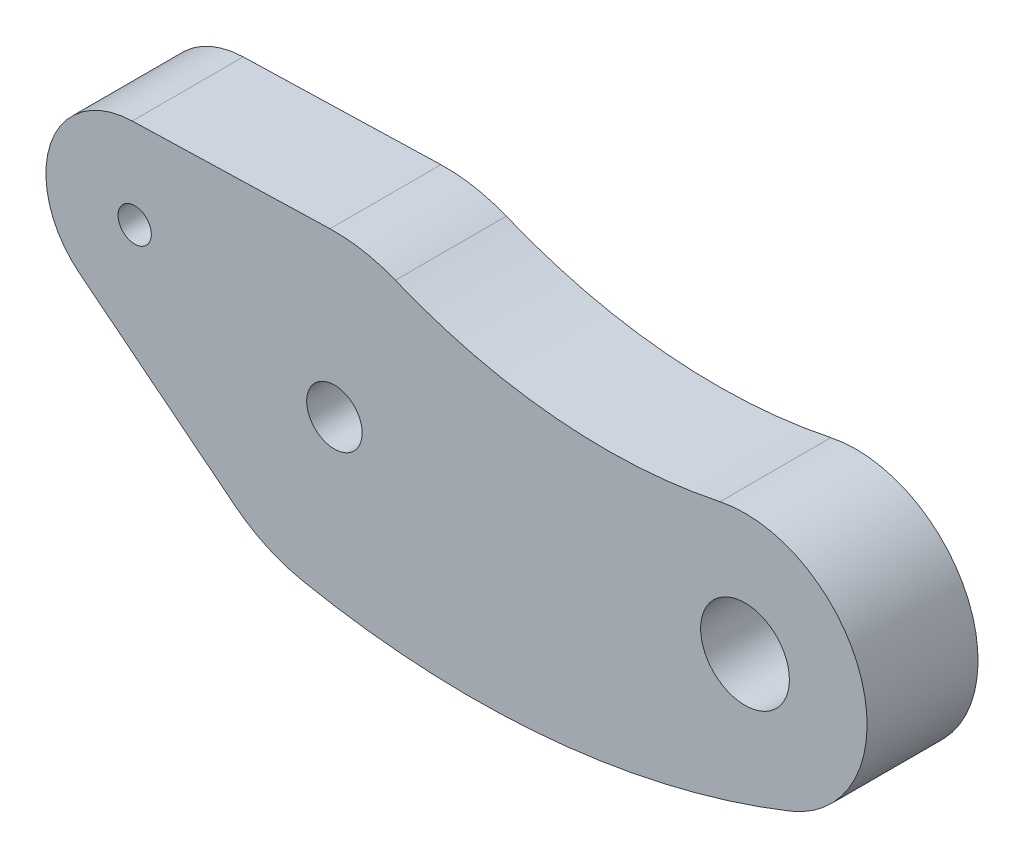
ISO-10303-21;
HEADER;
FILE_DESCRIPTION(('STEP AP214'),'2;1');
FILE_NAME('part.step','',(''),(''),'','','');
FILE_SCHEMA(('AUTOMOTIVE_DESIGN { 1 0 10303 214 1 1 1 1 }'));
ENDSEC;
DATA;
#1=APPLICATION_CONTEXT('core data for automotive mechanical design processes');
#2=APPLICATION_PROTOCOL_DEFINITION('international standard','automotive_design',2000,#1);
#3=PRODUCT_CONTEXT('',#1,'mechanical');
#4=PRODUCT('Part','Part','',(#3));
#5=PRODUCT_RELATED_PRODUCT_CATEGORY('part','',(#4));
#6=PRODUCT_DEFINITION_FORMATION('','',#4);
#7=PRODUCT_DEFINITION_CONTEXT('part definition',#1,'design');
#8=PRODUCT_DEFINITION('design','',#6,#7);
#9=PRODUCT_DEFINITION_SHAPE('','',#8);
#10=(LENGTH_UNIT() NAMED_UNIT(*) SI_UNIT(.MILLI.,.METRE.));
#11=(NAMED_UNIT(*) PLANE_ANGLE_UNIT() SI_UNIT($,.RADIAN.));
#12=(NAMED_UNIT(*) SI_UNIT($,.STERADIAN.) SOLID_ANGLE_UNIT());
#13=UNCERTAINTY_MEASURE_WITH_UNIT(LENGTH_MEASURE(1.E-05),#10,'distance_accuracy_value','');
#14=(GEOMETRIC_REPRESENTATION_CONTEXT(3) GLOBAL_UNCERTAINTY_ASSIGNED_CONTEXT((#13)) GLOBAL_UNIT_ASSIGNED_CONTEXT((#10,
#11,#12)) REPRESENTATION_CONTEXT('',''));
#15=CARTESIAN_POINT('',(0.,0.,0.));
#16=DIRECTION('',(0.,0.,1.));
#17=DIRECTION('',(1.,0.,0.));
#18=AXIS2_PLACEMENT_3D('',#15,#16,#17);
#19=CARTESIAN_POINT('',(0.,0.,5.));
#20=DIRECTION('',(0.,0.,1.));
#21=DIRECTION('',(1.,0.,0.));
#22=AXIS2_PLACEMENT_3D('',#19,#20,#21);
#23=PLANE('',#22);
#24=CARTESIAN_POINT('',(18.5,0.,5.));
#25=DIRECTION('',(0.,0.,1.));
#26=DIRECTION('',(1.,0.,0.));
#27=AXIS2_PLACEMENT_3D('',#24,#25,#26);
#28=CIRCLE('',#27,2.);
#29=CARTESIAN_POINT('',(20.5,0.,5.));
#30=VERTEX_POINT('',#29);
#31=EDGE_CURVE('E190',#30,#30,#28,.T.);
#32=ORIENTED_EDGE('',*,*,#31,.F.);
#33=EDGE_LOOP('',(#32));
#34=FACE_BOUND('',#33,.T.);
#35=CARTESIAN_POINT('',(0.,0.,5.));
#36=DIRECTION('',(0.,0.,1.));
#37=DIRECTION('',(1.,0.,0.));
#38=AXIS2_PLACEMENT_3D('',#35,#36,#37);
#39=CIRCLE('',#38,7.25);
#40=CARTESIAN_POINT('',(-4.51016983595542,-5.67634284119959,5.));
#41=VERTEX_POINT('',#40);
#42=CARTESIAN_POINT('',(-1.41925562194959,-7.10972668107322,5.));
#43=VERTEX_POINT('',#42);
#44=EDGE_CURVE('E153',#41,#43,#39,.T.);
#45=ORIENTED_EDGE('',*,*,#44,.T.);
#46=CARTESIAN_POINT('',(6.18063265327038,30.9617296569213,5.));
#47=DIRECTION('',(0.,0.,1.));
#48=DIRECTION('',(1.,0.,0.));
#49=AXIS2_PLACEMENT_3D('',#46,#47,#48);
#50=CIRCLE('',#49,38.8225976654274);
#51=CARTESIAN_POINT('',(20.5333504934794,-5.11033127797671,5.));
#52=VERTEX_POINT('',#51);
#53=EDGE_CURVE('E101',#43,#52,#50,.T.);
#54=ORIENTED_EDGE('',*,*,#53,.T.);
#55=CARTESIAN_POINT('',(18.5,0.,5.));
#56=DIRECTION('',(0.,0.,1.));
#57=DIRECTION('',(1.,0.,0.));
#58=AXIS2_PLACEMENT_3D('',#55,#56,#57);
#59=CIRCLE('',#58,5.5);
#60=CARTESIAN_POINT('',(17.369721809805,5.38260821654053,5.));
#61=VERTEX_POINT('',#60);
#62=EDGE_CURVE('E168',#52,#61,#59,.T.);
#63=ORIENTED_EDGE('',*,*,#62,.T.);
#64=CARTESIAN_POINT('',(12.2223776967446,29.8952785986359,5.));
#65=DIRECTION('',(0.,0.,-1.));
#66=DIRECTION('',(1.,0.,0.));
#67=AXIS2_PLACEMENT_3D('',#64,#65,#66);
#68=CIRCLE('',#67,25.0472785084431);
#69=CARTESIAN_POINT('',(2.74364412091977,6.71080598272238,5.));
#70=VERTEX_POINT('',#69);
#71=EDGE_CURVE('E181',#61,#70,#68,.T.);
#72=ORIENTED_EDGE('',*,*,#71,.T.);
#73=CARTESIAN_POINT('',(0.,0.,5.));
#74=DIRECTION('',(0.,0.,1.));
#75=DIRECTION('',(1.,0.,0.));
#76=AXIS2_PLACEMENT_3D('',#73,#74,#75);
#77=CIRCLE('',#76,7.25);
#78=CARTESIAN_POINT('',(-0.20233016404458,7.24717617453293,5.));
#79=VERTEX_POINT('',#78);
#80=EDGE_CURVE('E120',#70,#79,#77,.T.);
#81=ORIENTED_EDGE('',*,*,#80,.T.);
#82=DIRECTION('',(-0.999610506832128,-0.0279076088337353,0.));
#83=VECTOR('',#82,1.);
#84=CARTESIAN_POINT('',(-9.11163043533494,6.99844202732851,5.));
#85=LINE('',#84,#83);
#86=CARTESIAN_POINT('',(-9.11163043533494,6.99844202732851,5.));
#87=VERTEX_POINT('',#86);
#88=EDGE_CURVE('E114',#79,#87,#85,.T.);
#89=ORIENTED_EDGE('',*,*,#88,.T.);
#90=CARTESIAN_POINT('',(-9.,3.,5.));
#91=DIRECTION('',(0.,0.,1.));
#92=DIRECTION('',(1.,0.,0.));
#93=AXIS2_PLACEMENT_3D('',#90,#91,#92);
#94=CIRCLE('',#93,4.);
#95=CARTESIAN_POINT('',(-11.4883695646651,-0.131775360661842,5.));
#96=VERTEX_POINT('',#95);
#97=EDGE_CURVE('E118',#87,#96,#94,.T.);
#98=ORIENTED_EDGE('',*,*,#97,.T.);
#99=DIRECTION('',(0.782943840165461,-0.622092391166265,0.));
#100=VECTOR('',#99,1.);
#101=CARTESIAN_POINT('',(-11.4883695646651,-0.131775360661846,5.));
#102=LINE('',#101,#100);
#103=EDGE_CURVE('E58',#96,#41,#102,.T.);
#104=ORIENTED_EDGE('',*,*,#103,.T.);
#105=EDGE_LOOP('',(#45,#54,#63,#72,#81,#89,#98,#104));
#106=FACE_BOUND('',#105,.T.);
#107=CARTESIAN_POINT('',(0.,0.,5.));
#108=DIRECTION('',(0.,0.,1.));
#109=DIRECTION('',(1.,0.,0.));
#110=AXIS2_PLACEMENT_3D('',#107,#108,#109);
#111=CIRCLE('',#110,1.25);
#112=CARTESIAN_POINT('',(1.25,0.,5.));
#113=VERTEX_POINT('',#112);
#114=EDGE_CURVE('E142',#113,#113,#111,.T.);
#115=ORIENTED_EDGE('',*,*,#114,.F.);
#116=EDGE_LOOP('',(#115));
#117=FACE_BOUND('',#116,.T.);
#118=CARTESIAN_POINT('',(-9.,3.,5.));
#119=DIRECTION('',(0.,0.,1.));
#120=DIRECTION('',(1.,0.,0.));
#121=AXIS2_PLACEMENT_3D('',#118,#119,#120);
#122=CIRCLE('',#121,0.75);
#123=CARTESIAN_POINT('',(-8.25,3.,5.));
#124=VERTEX_POINT('',#123);
#125=EDGE_CURVE('E196',#124,#124,#122,.T.);
#126=ORIENTED_EDGE('',*,*,#125,.F.);
#127=EDGE_LOOP('',(#126));
#128=FACE_BOUND('',#127,.T.);
#129=ADVANCED_FACE('F41',(#34,#106,#117,#128),#23,.T.);
#130=CARTESIAN_POINT('',(0.,0.,0.));
#131=DIRECTION('',(0.,0.,1.));
#132=DIRECTION('',(1.,0.,0.));
#133=AXIS2_PLACEMENT_3D('',#130,#131,#132);
#134=PLANE('',#133);
#135=CARTESIAN_POINT('',(0.,0.,0.));
#136=DIRECTION('',(0.,0.,1.));
#137=DIRECTION('',(1.,0.,0.));
#138=AXIS2_PLACEMENT_3D('',#135,#136,#137);
#139=CIRCLE('',#138,7.25);
#140=CARTESIAN_POINT('',(-4.51016983595542,-5.67634284119959,0.));
#141=VERTEX_POINT('',#140);
#142=CARTESIAN_POINT('',(-1.41925562194959,-7.10972668107322,0.));
#143=VERTEX_POINT('',#142);
#144=EDGE_CURVE('E138',#141,#143,#139,.T.);
#145=ORIENTED_EDGE('',*,*,#144,.F.);
#146=DIRECTION('',(0.782943840165461,-0.622092391166265,0.));
#147=VECTOR('',#146,1.);
#148=CARTESIAN_POINT('',(-11.4883695646651,-0.131775360661846,0.));
#149=LINE('',#148,#147);
#150=CARTESIAN_POINT('',(-11.4883695646651,-0.131775360661842,0.));
#151=VERTEX_POINT('',#150);
#152=EDGE_CURVE('E93',#151,#141,#149,.T.);
#153=ORIENTED_EDGE('',*,*,#152,.F.);
#154=CARTESIAN_POINT('',(-9.,3.,0.));
#155=DIRECTION('',(0.,0.,1.));
#156=DIRECTION('',(1.,0.,0.));
#157=AXIS2_PLACEMENT_3D('',#154,#155,#156);
#158=CIRCLE('',#157,4.);
#159=CARTESIAN_POINT('',(-9.11163043533494,6.99844202732851,0.));
#160=VERTEX_POINT('',#159);
#161=EDGE_CURVE('E87',#160,#151,#158,.T.);
#162=ORIENTED_EDGE('',*,*,#161,.F.);
#163=DIRECTION('',(-0.999610506832128,-0.0279076088337353,0.));
#164=VECTOR('',#163,1.);
#165=CARTESIAN_POINT('',(-9.11163043533494,6.99844202732851,0.));
#166=LINE('',#165,#164);
#167=CARTESIAN_POINT('',(-0.20233016404458,7.24717617453293,0.));
#168=VERTEX_POINT('',#167);
#169=EDGE_CURVE('E128',#168,#160,#166,.T.);
#170=ORIENTED_EDGE('',*,*,#169,.F.);
#171=CARTESIAN_POINT('',(0.,0.,0.));
#172=DIRECTION('',(0.,0.,1.));
#173=DIRECTION('',(1.,0.,0.));
#174=AXIS2_PLACEMENT_3D('',#171,#172,#173);
#175=CIRCLE('',#174,7.25);
#176=CARTESIAN_POINT('',(2.74364412091977,6.71080598272238,0.));
#177=VERTEX_POINT('',#176);
#178=EDGE_CURVE('E148',#177,#168,#175,.T.);
#179=ORIENTED_EDGE('',*,*,#178,.F.);
#180=CARTESIAN_POINT('',(12.2223776967446,29.8952785986359,0.));
#181=DIRECTION('',(0.,0.,-1.));
#182=DIRECTION('',(1.,0.,0.));
#183=AXIS2_PLACEMENT_3D('',#180,#181,#182);
#184=CIRCLE('',#183,25.0472785084431);
#185=CARTESIAN_POINT('',(17.369721809805,5.38260821654053,0.));
#186=VERTEX_POINT('',#185);
#187=EDGE_CURVE('E146',#186,#177,#184,.T.);
#188=ORIENTED_EDGE('',*,*,#187,.F.);
#189=CARTESIAN_POINT('',(18.5,0.,0.));
#190=DIRECTION('',(0.,0.,1.));
#191=DIRECTION('',(1.,0.,0.));
#192=AXIS2_PLACEMENT_3D('',#189,#190,#191);
#193=CIRCLE('',#192,5.5);
#194=CARTESIAN_POINT('',(20.5333504934794,-5.11033127797671,0.));
#195=VERTEX_POINT('',#194);
#196=EDGE_CURVE('E144',#195,#186,#193,.T.);
#197=ORIENTED_EDGE('',*,*,#196,.F.);
#198=CARTESIAN_POINT('',(6.18063265327038,30.9617296569213,0.));
#199=DIRECTION('',(0.,0.,1.));
#200=DIRECTION('',(1.,0.,0.));
#201=AXIS2_PLACEMENT_3D('',#198,#199,#200);
#202=CIRCLE('',#201,38.8225976654274);
#203=EDGE_CURVE('E141',#143,#195,#202,.T.);
#204=ORIENTED_EDGE('',*,*,#203,.F.);
#205=EDGE_LOOP('',(#145,#153,#162,#170,#179,#188,#197,#204));
#206=FACE_BOUND('',#205,.T.);
#207=CARTESIAN_POINT('',(0.,0.,0.));
#208=DIRECTION('',(0.,0.,1.));
#209=DIRECTION('',(1.,0.,0.));
#210=AXIS2_PLACEMENT_3D('',#207,#208,#209);
#211=CIRCLE('',#210,1.25);
#212=CARTESIAN_POINT('',(1.25,0.,0.));
#213=VERTEX_POINT('',#212);
#214=EDGE_CURVE('E187',#213,#213,#211,.T.);
#215=ORIENTED_EDGE('',*,*,#214,.T.);
#216=EDGE_LOOP('',(#215));
#217=FACE_BOUND('',#216,.T.);
#218=CARTESIAN_POINT('',(18.5,0.,0.));
#219=DIRECTION('',(0.,0.,1.));
#220=DIRECTION('',(1.,0.,0.));
#221=AXIS2_PLACEMENT_3D('',#218,#219,#220);
#222=CIRCLE('',#221,2.);
#223=CARTESIAN_POINT('',(20.5,0.,0.));
#224=VERTEX_POINT('',#223);
#225=EDGE_CURVE('E193',#224,#224,#222,.T.);
#226=ORIENTED_EDGE('',*,*,#225,.T.);
#227=EDGE_LOOP('',(#226));
#228=FACE_BOUND('',#227,.T.);
#229=CARTESIAN_POINT('',(-9.,3.,0.));
#230=DIRECTION('',(0.,0.,1.));
#231=DIRECTION('',(1.,0.,0.));
#232=AXIS2_PLACEMENT_3D('',#229,#230,#231);
#233=CIRCLE('',#232,0.75);
#234=CARTESIAN_POINT('',(-8.25,3.,0.));
#235=VERTEX_POINT('',#234);
#236=EDGE_CURVE('E199',#235,#235,#233,.T.);
#237=ORIENTED_EDGE('',*,*,#236,.T.);
#238=EDGE_LOOP('',(#237));
#239=FACE_BOUND('',#238,.T.);
#240=ADVANCED_FACE('F172',(#206,#217,#228,#239),#134,.F.);
#241=CARTESIAN_POINT('',(0.,0.,5.));
#242=DIRECTION('',(0.,0.,-1.));
#243=DIRECTION('',(-1.,0.,0.));
#244=AXIS2_PLACEMENT_3D('',#241,#242,#243);
#245=CYLINDRICAL_SURFACE('',#244,7.25);
#246=ORIENTED_EDGE('',*,*,#144,.T.);
#247=DIRECTION('',(0.,0.,-1.));
#248=VECTOR('',#247,1.);
#249=CARTESIAN_POINT('',(-1.41925562194959,-7.10972668107322,5.));
#250=LINE('',#249,#248);
#251=EDGE_CURVE('E11',#43,#143,#250,.T.);
#252=ORIENTED_EDGE('',*,*,#251,.F.);
#253=ORIENTED_EDGE('',*,*,#44,.F.);
#254=DIRECTION('',(0.,0.,-1.));
#255=VECTOR('',#254,1.);
#256=CARTESIAN_POINT('',(-4.51016983595542,-5.67634284119959,5.));
#257=LINE('',#256,#255);
#258=EDGE_CURVE('E134',#41,#141,#257,.T.);
#259=ORIENTED_EDGE('',*,*,#258,.T.);
#260=EDGE_LOOP('',(#246,#252,#253,#259));
#261=FACE_BOUND('',#260,.T.);
#262=ADVANCED_FACE('F43',(#261),#245,.T.);
#263=CARTESIAN_POINT('',(6.18063265327038,30.9617296569213,5.));
#264=DIRECTION('',(0.,0.,-1.));
#265=DIRECTION('',(-1.,0.,0.));
#266=AXIS2_PLACEMENT_3D('',#263,#264,#265);
#267=CYLINDRICAL_SURFACE('',#266,38.8225976654274);
#268=ORIENTED_EDGE('',*,*,#203,.T.);
#269=DIRECTION('',(0.,0.,-1.));
#270=VECTOR('',#269,1.);
#271=CARTESIAN_POINT('',(20.5333504934794,-5.11033127797671,5.));
#272=LINE('',#271,#270);
#273=EDGE_CURVE('E50',#52,#195,#272,.T.);
#274=ORIENTED_EDGE('',*,*,#273,.F.);
#275=ORIENTED_EDGE('',*,*,#53,.F.);
#276=ORIENTED_EDGE('',*,*,#251,.T.);
#277=EDGE_LOOP('',(#268,#274,#275,#276));
#278=FACE_BOUND('',#277,.T.);
#279=ADVANCED_FACE('F232',(#278),#267,.T.);
#280=CARTESIAN_POINT('',(18.5,0.,5.));
#281=DIRECTION('',(0.,0.,-1.));
#282=DIRECTION('',(-1.,0.,0.));
#283=AXIS2_PLACEMENT_3D('',#280,#281,#282);
#284=CYLINDRICAL_SURFACE('',#283,5.5);
#285=ORIENTED_EDGE('',*,*,#196,.T.);
#286=DIRECTION('',(0.,0.,-1.));
#287=VECTOR('',#286,1.);
#288=CARTESIAN_POINT('',(17.369721809805,5.38260821654053,5.));
#289=LINE('',#288,#287);
#290=EDGE_CURVE('E160',#61,#186,#289,.T.);
#291=ORIENTED_EDGE('',*,*,#290,.F.);
#292=ORIENTED_EDGE('',*,*,#62,.F.);
#293=ORIENTED_EDGE('',*,*,#273,.T.);
#294=EDGE_LOOP('',(#285,#291,#292,#293));
#295=FACE_BOUND('',#294,.T.);
#296=ADVANCED_FACE('F166',(#295),#284,.T.);
#297=CARTESIAN_POINT('',(12.2223776967446,29.8952785986359,5.));
#298=DIRECTION('',(0.,0.,-1.));
#299=DIRECTION('',(-1.,0.,0.));
#300=AXIS2_PLACEMENT_3D('',#297,#298,#299);
#301=CYLINDRICAL_SURFACE('',#300,25.0472785084431);
#302=ORIENTED_EDGE('',*,*,#187,.T.);
#303=DIRECTION('',(0.,0.,-1.));
#304=VECTOR('',#303,1.);
#305=CARTESIAN_POINT('',(2.74364412091977,6.71080598272238,5.));
#306=LINE('',#305,#304);
#307=EDGE_CURVE('E157',#70,#177,#306,.T.);
#308=ORIENTED_EDGE('',*,*,#307,.F.);
#309=ORIENTED_EDGE('',*,*,#71,.F.);
#310=ORIENTED_EDGE('',*,*,#290,.T.);
#311=EDGE_LOOP('',(#302,#308,#309,#310));
#312=FACE_BOUND('',#311,.T.);
#313=ADVANCED_FACE('F177',(#312),#301,.F.);
#314=CARTESIAN_POINT('',(0.,0.,5.));
#315=DIRECTION('',(0.,0.,-1.));
#316=DIRECTION('',(-1.,0.,0.));
#317=AXIS2_PLACEMENT_3D('',#314,#315,#316);
#318=CYLINDRICAL_SURFACE('',#317,7.25);
#319=ORIENTED_EDGE('',*,*,#178,.T.);
#320=DIRECTION('',(0.,0.,-1.));
#321=VECTOR('',#320,1.);
#322=CARTESIAN_POINT('',(-0.20233016404458,7.24717617453293,5.));
#323=LINE('',#322,#321);
#324=EDGE_CURVE('E129',#79,#168,#323,.T.);
#325=ORIENTED_EDGE('',*,*,#324,.F.);
#326=ORIENTED_EDGE('',*,*,#80,.F.);
#327=ORIENTED_EDGE('',*,*,#307,.T.);
#328=EDGE_LOOP('',(#319,#325,#326,#327));
#329=FACE_BOUND('',#328,.T.);
#330=ADVANCED_FACE('F180',(#329),#318,.T.);
#331=CARTESIAN_POINT('',(-9.11163043533494,6.99844202732851,5.));
#332=DIRECTION('',(0.0279076088337353,-0.999610506832128,0.));
#333=DIRECTION('',(0.999610506832128,0.0279076088337353,0.));
#334=AXIS2_PLACEMENT_3D('',#331,#332,#333);
#335=PLANE('',#334);
#336=ORIENTED_EDGE('',*,*,#169,.T.);
#337=DIRECTION('',(0.,0.,-1.));
#338=VECTOR('',#337,1.);
#339=CARTESIAN_POINT('',(-9.11163043533494,6.99844202732851,5.));
#340=LINE('',#339,#338);
#341=EDGE_CURVE('E125',#87,#160,#340,.T.);
#342=ORIENTED_EDGE('',*,*,#341,.F.);
#343=ORIENTED_EDGE('',*,*,#88,.F.);
#344=ORIENTED_EDGE('',*,*,#324,.T.);
#345=EDGE_LOOP('',(#336,#342,#343,#344));
#346=FACE_BOUND('',#345,.T.);
#347=ADVANCED_FACE('F126',(#346),#335,.F.);
#348=CARTESIAN_POINT('',(-9.,3.,5.));
#349=DIRECTION('',(0.,0.,-1.));
#350=DIRECTION('',(-1.,0.,0.));
#351=AXIS2_PLACEMENT_3D('',#348,#349,#350);
#352=CYLINDRICAL_SURFACE('',#351,4.);
#353=ORIENTED_EDGE('',*,*,#161,.T.);
#354=DIRECTION('',(0.,0.,-1.));
#355=VECTOR('',#354,1.);
#356=CARTESIAN_POINT('',(-11.4883695646651,-0.131775360661842,5.));
#357=LINE('',#356,#355);
#358=EDGE_CURVE('E130',#96,#151,#357,.T.);
#359=ORIENTED_EDGE('',*,*,#358,.F.);
#360=ORIENTED_EDGE('',*,*,#97,.F.);
#361=ORIENTED_EDGE('',*,*,#341,.T.);
#362=EDGE_LOOP('',(#353,#359,#360,#361));
#363=FACE_BOUND('',#362,.T.);
#364=ADVANCED_FACE('F132',(#363),#352,.T.);
#365=CARTESIAN_POINT('',(-11.4883695646651,-0.131775360661846,5.));
#366=DIRECTION('',(0.622092391166265,0.782943840165461,0.));
#367=DIRECTION('',(-0.782943840165461,0.622092391166265,0.));
#368=AXIS2_PLACEMENT_3D('',#365,#366,#367);
#369=PLANE('',#368);
#370=ORIENTED_EDGE('',*,*,#152,.T.);
#371=ORIENTED_EDGE('',*,*,#258,.F.);
#372=ORIENTED_EDGE('',*,*,#103,.F.);
#373=ORIENTED_EDGE('',*,*,#358,.T.);
#374=EDGE_LOOP('',(#370,#371,#372,#373));
#375=FACE_BOUND('',#374,.T.);
#376=ADVANCED_FACE('F220',(#375),#369,.F.);
#377=CARTESIAN_POINT('',(0.,0.,5.));
#378=DIRECTION('',(0.,0.,-1.));
#379=DIRECTION('',(-1.,0.,0.));
#380=AXIS2_PLACEMENT_3D('',#377,#378,#379);
#381=CYLINDRICAL_SURFACE('',#380,1.25);
#382=ORIENTED_EDGE('',*,*,#114,.T.);
#383=EDGE_LOOP('',(#382));
#384=FACE_BOUND('',#383,.T.);
#385=ORIENTED_EDGE('',*,*,#214,.F.);
#386=EDGE_LOOP('',(#385));
#387=FACE_BOUND('',#386,.T.);
#388=ADVANCED_FACE('F217',(#384,#387),#381,.F.);
#389=CARTESIAN_POINT('',(18.5,0.,5.));
#390=DIRECTION('',(0.,0.,-1.));
#391=DIRECTION('',(-1.,0.,0.));
#392=AXIS2_PLACEMENT_3D('',#389,#390,#391);
#393=CYLINDRICAL_SURFACE('',#392,2.);
#394=ORIENTED_EDGE('',*,*,#31,.T.);
#395=EDGE_LOOP('',(#394));
#396=FACE_BOUND('',#395,.T.);
#397=ORIENTED_EDGE('',*,*,#225,.F.);
#398=EDGE_LOOP('',(#397));
#399=FACE_BOUND('',#398,.T.);
#400=ADVANCED_FACE('F267',(#396,#399),#393,.F.);
#401=CARTESIAN_POINT('',(-9.,3.,5.));
#402=DIRECTION('',(0.,0.,-1.));
#403=DIRECTION('',(-1.,0.,0.));
#404=AXIS2_PLACEMENT_3D('',#401,#402,#403);
#405=CYLINDRICAL_SURFACE('',#404,0.75);
#406=ORIENTED_EDGE('',*,*,#125,.T.);
#407=EDGE_LOOP('',(#406));
#408=FACE_BOUND('',#407,.T.);
#409=ORIENTED_EDGE('',*,*,#236,.F.);
#410=EDGE_LOOP('',(#409));
#411=FACE_BOUND('',#410,.T.);
#412=ADVANCED_FACE('F205',(#408,#411),#405,.F.);
#413=CLOSED_SHELL('',(#129,#240,#262,#279,#296,#313,#330,#347,#364,#376,#388,#400,#412));
#414=MANIFOLD_SOLID_BREP('B2',#413);
#415=ADVANCED_BREP_SHAPE_REPRESENTATION('',(#18,#414),#14);
#416=SHAPE_DEFINITION_REPRESENTATION(#9,#415);
ENDSEC;
END-ISO-10303-21;
